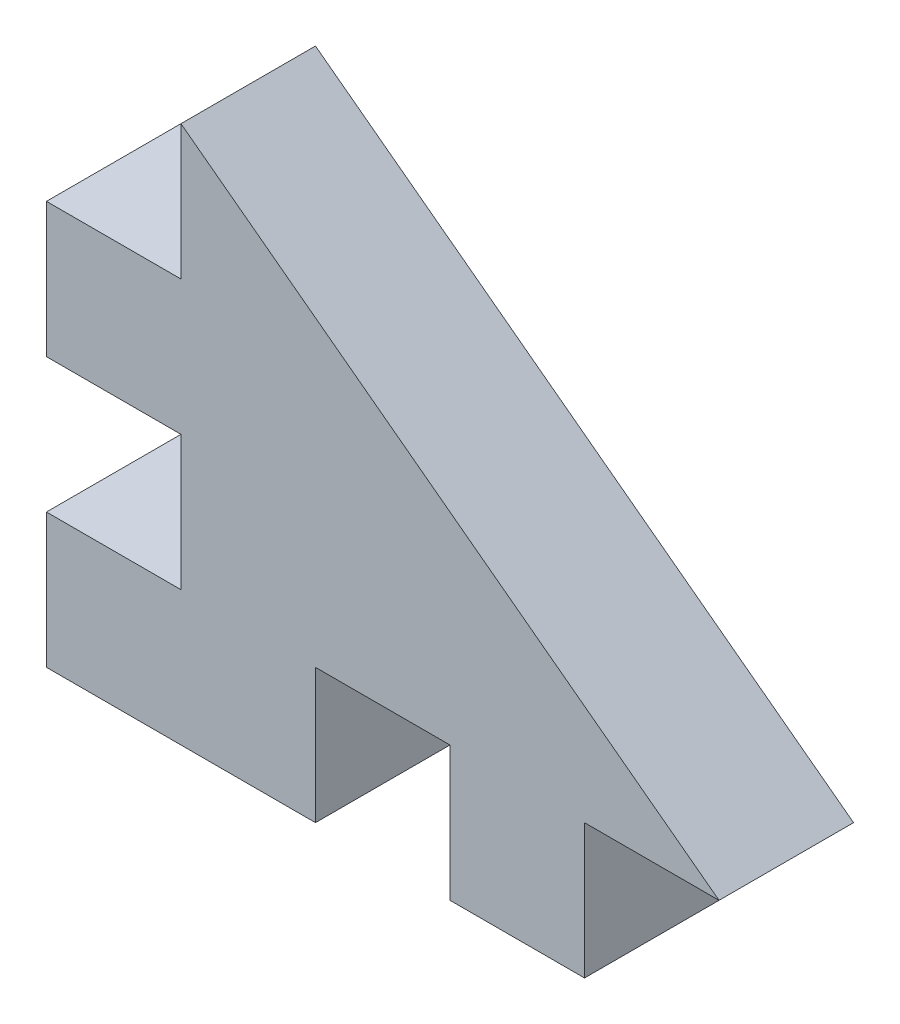
ISO-10303-21;
HEADER;
FILE_DESCRIPTION(('STEP AP214'),'2;1');
FILE_NAME('part.step','',(''),(''),'','','');
FILE_SCHEMA(('AUTOMOTIVE_DESIGN { 1 0 10303 214 1 1 1 1 }'));
ENDSEC;
DATA;
#1=APPLICATION_CONTEXT('core data for automotive mechanical design processes');
#2=APPLICATION_PROTOCOL_DEFINITION('international standard','automotive_design',2000,#1);
#3=PRODUCT_CONTEXT('',#1,'mechanical');
#4=PRODUCT('Part','Part','',(#3));
#5=PRODUCT_RELATED_PRODUCT_CATEGORY('part','',(#4));
#6=PRODUCT_DEFINITION_FORMATION('','',#4);
#7=PRODUCT_DEFINITION_CONTEXT('part definition',#1,'design');
#8=PRODUCT_DEFINITION('design','',#6,#7);
#9=PRODUCT_DEFINITION_SHAPE('','',#8);
#10=(LENGTH_UNIT() NAMED_UNIT(*) SI_UNIT(.MILLI.,.METRE.));
#11=(NAMED_UNIT(*) PLANE_ANGLE_UNIT() SI_UNIT($,.RADIAN.));
#12=(NAMED_UNIT(*) SI_UNIT($,.STERADIAN.) SOLID_ANGLE_UNIT());
#13=UNCERTAINTY_MEASURE_WITH_UNIT(LENGTH_MEASURE(1.E-05),#10,'distance_accuracy_value','');
#14=(GEOMETRIC_REPRESENTATION_CONTEXT(3) GLOBAL_UNCERTAINTY_ASSIGNED_CONTEXT((#13)) GLOBAL_UNIT_ASSIGNED_CONTEXT((#10,
#11,#12)) REPRESENTATION_CONTEXT('',''));
#15=CARTESIAN_POINT('',(0.,0.,0.));
#16=DIRECTION('',(0.,0.,1.));
#17=DIRECTION('',(1.,0.,0.));
#18=AXIS2_PLACEMENT_3D('',#15,#16,#17);
#19=CARTESIAN_POINT('',(0.,0.,5.));
#20=DIRECTION('',(0.,0.,1.));
#21=DIRECTION('',(1.,0.,0.));
#22=AXIS2_PLACEMENT_3D('',#19,#20,#21);
#23=PLANE('',#22);
#24=DIRECTION('',(0.,1.,0.));
#25=VECTOR('',#24,1.);
#26=CARTESIAN_POINT('',(-23.2430417966123,0.,5.));
#27=LINE('',#26,#25);
#28=CARTESIAN_POINT('',(-23.2430417966123,-5.73647342995169,5.));
#29=VERTEX_POINT('',#28);
#30=CARTESIAN_POINT('',(-23.2430417966123,-0.736473429951691,5.));
#31=VERTEX_POINT('',#30);
#32=EDGE_CURVE('E223',#29,#31,#27,.T.);
#33=ORIENTED_EDGE('',*,*,#32,.T.);
#34=DIRECTION('',(1.,0.,0.));
#35=VECTOR('',#34,1.);
#36=CARTESIAN_POINT('',(0.,-0.736473429951691,5.));
#37=LINE('',#36,#35);
#38=CARTESIAN_POINT('',(-18.2430417966123,-0.736473429951584,5.));
#39=VERTEX_POINT('',#38);
#40=EDGE_CURVE('E207',#31,#39,#37,.T.);
#41=ORIENTED_EDGE('',*,*,#40,.T.);
#42=DIRECTION('',(0.800000000000003,-0.599999999999996,0.));
#43=VECTOR('',#42,1.);
#44=CARTESIAN_POINT('',(-6.92100229315709,-9.22800305754288,5.));
#45=LINE('',#44,#43);
#46=CARTESIAN_POINT('',(-38.2430417966123,14.2635265700483,5.));
#47=VERTEX_POINT('',#46);
#48=EDGE_CURVE('E221',#47,#39,#45,.T.);
#49=ORIENTED_EDGE('',*,*,#48,.F.);
#50=DIRECTION('',(0.,1.,0.));
#51=VECTOR('',#50,1.);
#52=CARTESIAN_POINT('',(-38.2430417966123,0.,5.));
#53=LINE('',#52,#51);
#54=CARTESIAN_POINT('',(-38.2430417966123,9.26352657004831,5.));
#55=VERTEX_POINT('',#54);
#56=EDGE_CURVE('E229',#55,#47,#53,.T.);
#57=ORIENTED_EDGE('',*,*,#56,.F.);
#58=DIRECTION('',(1.,0.,0.));
#59=VECTOR('',#58,1.);
#60=CARTESIAN_POINT('',(0.,9.26352657004831,5.));
#61=LINE('',#60,#59);
#62=CARTESIAN_POINT('',(-43.2430417966123,9.26352657004831,5.));
#63=VERTEX_POINT('',#62);
#64=EDGE_CURVE('E232',#63,#55,#61,.T.);
#65=ORIENTED_EDGE('',*,*,#64,.F.);
#66=DIRECTION('',(0.,-1.,0.));
#67=VECTOR('',#66,1.);
#68=CARTESIAN_POINT('',(-43.2430417966123,14.2635265700483,5.));
#69=LINE('',#68,#67);
#70=CARTESIAN_POINT('',(-43.2430417966123,4.26352657004831,5.));
#71=VERTEX_POINT('',#70);
#72=EDGE_CURVE('E237',#63,#71,#69,.T.);
#73=ORIENTED_EDGE('',*,*,#72,.T.);
#74=DIRECTION('',(1.,0.,0.));
#75=VECTOR('',#74,1.);
#76=CARTESIAN_POINT('',(0.,4.26352657004831,5.));
#77=LINE('',#76,#75);
#78=CARTESIAN_POINT('',(-38.2430417966123,4.26352657004831,5.));
#79=VERTEX_POINT('',#78);
#80=EDGE_CURVE('E297',#71,#79,#77,.T.);
#81=ORIENTED_EDGE('',*,*,#80,.T.);
#82=DIRECTION('',(0.,1.,0.));
#83=VECTOR('',#82,1.);
#84=CARTESIAN_POINT('',(-38.2430417966123,0.,5.));
#85=LINE('',#84,#83);
#86=CARTESIAN_POINT('',(-38.2430417966123,-0.736473429951691,5.));
#87=VERTEX_POINT('',#86);
#88=EDGE_CURVE('E305',#87,#79,#85,.T.);
#89=ORIENTED_EDGE('',*,*,#88,.F.);
#90=DIRECTION('',(1.,0.,0.));
#91=VECTOR('',#90,1.);
#92=CARTESIAN_POINT('',(0.,-0.736473429951691,5.));
#93=LINE('',#92,#91);
#94=CARTESIAN_POINT('',(-43.2430417966123,-0.736473429951691,5.));
#95=VERTEX_POINT('',#94);
#96=EDGE_CURVE('E288',#95,#87,#93,.T.);
#97=ORIENTED_EDGE('',*,*,#96,.F.);
#98=CARTESIAN_POINT('',(-43.2430417966123,-5.73647342995169,5.));
#99=VERTEX_POINT('',#98);
#100=EDGE_CURVE('E241',#95,#99,#69,.T.);
#101=ORIENTED_EDGE('',*,*,#100,.T.);
#102=DIRECTION('',(1.,0.,0.));
#103=VECTOR('',#102,1.);
#104=CARTESIAN_POINT('',(-43.2430417966123,-5.73647342995169,5.));
#105=LINE('',#104,#103);
#106=CARTESIAN_POINT('',(-33.2430417966123,-5.73647342995169,5.));
#107=VERTEX_POINT('',#106);
#108=EDGE_CURVE('E103',#99,#107,#105,.T.);
#109=ORIENTED_EDGE('',*,*,#108,.T.);
#110=DIRECTION('',(0.,1.,0.));
#111=VECTOR('',#110,1.);
#112=CARTESIAN_POINT('',(-33.2430417966123,0.,5.));
#113=LINE('',#112,#111);
#114=CARTESIAN_POINT('',(-33.2430417966123,-0.736473429951691,5.));
#115=VERTEX_POINT('',#114);
#116=EDGE_CURVE('E278',#107,#115,#113,.T.);
#117=ORIENTED_EDGE('',*,*,#116,.T.);
#118=DIRECTION('',(1.,0.,0.));
#119=VECTOR('',#118,1.);
#120=CARTESIAN_POINT('',(0.,-0.736473429951691,5.));
#121=LINE('',#120,#119);
#122=CARTESIAN_POINT('',(-28.2430417966123,-0.736473429951691,5.));
#123=VERTEX_POINT('',#122);
#124=EDGE_CURVE('E271',#115,#123,#121,.T.);
#125=ORIENTED_EDGE('',*,*,#124,.T.);
#126=DIRECTION('',(0.,1.,0.));
#127=VECTOR('',#126,1.);
#128=CARTESIAN_POINT('',(-28.2430417966123,0.,5.));
#129=LINE('',#128,#127);
#130=CARTESIAN_POINT('',(-28.2430417966123,-5.73647342995169,5.));
#131=VERTEX_POINT('',#130);
#132=EDGE_CURVE('E269',#131,#123,#129,.T.);
#133=ORIENTED_EDGE('',*,*,#132,.F.);
#134=EDGE_CURVE('E240',#131,#29,#105,.T.);
#135=ORIENTED_EDGE('',*,*,#134,.T.);
#136=EDGE_LOOP('',(#33,#41,#49,#57,#65,#73,#81,#89,#97,#101,#109,#117,#125,#133,#135));
#137=FACE_BOUND('',#136,.T.);
#138=ADVANCED_FACE('F95',(#137),#23,.T.);
#139=CARTESIAN_POINT('',(0.,0.,0.));
#140=DIRECTION('',(0.,0.,1.));
#141=DIRECTION('',(1.,0.,0.));
#142=AXIS2_PLACEMENT_3D('',#139,#140,#141);
#143=PLANE('',#142);
#144=DIRECTION('',(1.,0.,0.));
#145=VECTOR('',#144,1.);
#146=CARTESIAN_POINT('',(0.,-0.736473429951691,0.));
#147=LINE('',#146,#145);
#148=CARTESIAN_POINT('',(-23.2430417966123,-0.736473429951691,0.));
#149=VERTEX_POINT('',#148);
#150=CARTESIAN_POINT('',(-18.2430417966123,-0.736473429951579,0.));
#151=VERTEX_POINT('',#150);
#152=EDGE_CURVE('E210',#149,#151,#147,.T.);
#153=ORIENTED_EDGE('',*,*,#152,.F.);
#154=DIRECTION('',(0.,1.,0.));
#155=VECTOR('',#154,1.);
#156=CARTESIAN_POINT('',(-23.2430417966123,0.,0.));
#157=LINE('',#156,#155);
#158=CARTESIAN_POINT('',(-23.2430417966123,-5.73647342995169,0.));
#159=VERTEX_POINT('',#158);
#160=EDGE_CURVE('E267',#159,#149,#157,.T.);
#161=ORIENTED_EDGE('',*,*,#160,.F.);
#162=DIRECTION('',(1.,0.,0.));
#163=VECTOR('',#162,1.);
#164=CARTESIAN_POINT('',(-43.2430417966123,-5.73647342995169,0.));
#165=LINE('',#164,#163);
#166=CARTESIAN_POINT('',(-28.2430417966123,-5.73647342995169,0.));
#167=VERTEX_POINT('',#166);
#168=EDGE_CURVE('E246',#167,#159,#165,.T.);
#169=ORIENTED_EDGE('',*,*,#168,.F.);
#170=DIRECTION('',(0.,1.,0.));
#171=VECTOR('',#170,1.);
#172=CARTESIAN_POINT('',(-28.2430417966123,0.,0.));
#173=LINE('',#172,#171);
#174=CARTESIAN_POINT('',(-28.2430417966123,-0.736473429951691,0.));
#175=VERTEX_POINT('',#174);
#176=EDGE_CURVE('E266',#167,#175,#173,.T.);
#177=ORIENTED_EDGE('',*,*,#176,.T.);
#178=DIRECTION('',(1.,0.,0.));
#179=VECTOR('',#178,1.);
#180=CARTESIAN_POINT('',(0.,-0.736473429951691,0.));
#181=LINE('',#180,#179);
#182=CARTESIAN_POINT('',(-33.2430417966123,-0.736473429951691,0.));
#183=VERTEX_POINT('',#182);
#184=EDGE_CURVE('E277',#183,#175,#181,.T.);
#185=ORIENTED_EDGE('',*,*,#184,.F.);
#186=DIRECTION('',(0.,1.,0.));
#187=VECTOR('',#186,1.);
#188=CARTESIAN_POINT('',(-33.2430417966123,0.,0.));
#189=LINE('',#188,#187);
#190=CARTESIAN_POINT('',(-33.2430417966123,-5.73647342995169,0.));
#191=VERTEX_POINT('',#190);
#192=EDGE_CURVE('E280',#191,#183,#189,.T.);
#193=ORIENTED_EDGE('',*,*,#192,.F.);
#194=CARTESIAN_POINT('',(-43.2430417966123,-5.73647342995169,0.));
#195=VERTEX_POINT('',#194);
#196=EDGE_CURVE('E247',#195,#191,#165,.T.);
#197=ORIENTED_EDGE('',*,*,#196,.F.);
#198=DIRECTION('',(0.,-1.,0.));
#199=VECTOR('',#198,1.);
#200=CARTESIAN_POINT('',(-43.2430417966123,14.2635265700483,0.));
#201=LINE('',#200,#199);
#202=CARTESIAN_POINT('',(-43.2430417966123,-0.736473429951691,0.));
#203=VERTEX_POINT('',#202);
#204=EDGE_CURVE('E215',#203,#195,#201,.T.);
#205=ORIENTED_EDGE('',*,*,#204,.F.);
#206=DIRECTION('',(1.,0.,0.));
#207=VECTOR('',#206,1.);
#208=CARTESIAN_POINT('',(0.,-0.736473429951691,0.));
#209=LINE('',#208,#207);
#210=CARTESIAN_POINT('',(-38.2430417966123,-0.736473429951691,0.));
#211=VERTEX_POINT('',#210);
#212=EDGE_CURVE('E293',#203,#211,#209,.T.);
#213=ORIENTED_EDGE('',*,*,#212,.T.);
#214=DIRECTION('',(0.,1.,0.));
#215=VECTOR('',#214,1.);
#216=CARTESIAN_POINT('',(-38.2430417966123,0.,0.));
#217=LINE('',#216,#215);
#218=CARTESIAN_POINT('',(-38.2430417966123,4.26352657004831,0.));
#219=VERTEX_POINT('',#218);
#220=EDGE_CURVE('E296',#211,#219,#217,.T.);
#221=ORIENTED_EDGE('',*,*,#220,.T.);
#222=DIRECTION('',(1.,0.,0.));
#223=VECTOR('',#222,1.);
#224=CARTESIAN_POINT('',(0.,4.26352657004831,0.));
#225=LINE('',#224,#223);
#226=CARTESIAN_POINT('',(-43.2430417966123,4.26352657004831,0.));
#227=VERTEX_POINT('',#226);
#228=EDGE_CURVE('E300',#227,#219,#225,.T.);
#229=ORIENTED_EDGE('',*,*,#228,.F.);
#230=CARTESIAN_POINT('',(-43.2430417966123,9.26352657004831,0.));
#231=VERTEX_POINT('',#230);
#232=EDGE_CURVE('E244',#231,#227,#201,.T.);
#233=ORIENTED_EDGE('',*,*,#232,.F.);
#234=DIRECTION('',(1.,0.,0.));
#235=VECTOR('',#234,1.);
#236=CARTESIAN_POINT('',(0.,9.26352657004831,0.));
#237=LINE('',#236,#235);
#238=CARTESIAN_POINT('',(-38.2430417966123,9.26352657004831,0.));
#239=VERTEX_POINT('',#238);
#240=EDGE_CURVE('E311',#231,#239,#237,.T.);
#241=ORIENTED_EDGE('',*,*,#240,.T.);
#242=DIRECTION('',(0.,1.,0.));
#243=VECTOR('',#242,1.);
#244=CARTESIAN_POINT('',(-38.2430417966123,0.,0.));
#245=LINE('',#244,#243);
#246=CARTESIAN_POINT('',(-38.2430417966123,14.2635265700483,0.));
#247=VERTEX_POINT('',#246);
#248=EDGE_CURVE('E320',#239,#247,#245,.T.);
#249=ORIENTED_EDGE('',*,*,#248,.T.);
#250=DIRECTION('',(0.800000000000003,-0.599999999999996,0.));
#251=VECTOR('',#250,1.);
#252=CARTESIAN_POINT('',(-6.92100229315709,-9.22800305754288,0.));
#253=LINE('',#252,#251);
#254=EDGE_CURVE('E228',#247,#151,#253,.T.);
#255=ORIENTED_EDGE('',*,*,#254,.T.);
#256=EDGE_LOOP('',(#153,#161,#169,#177,#185,#193,#197,#205,#213,#221,#229,#233,#241,#249,#255));
#257=FACE_BOUND('',#256,.T.);
#258=ADVANCED_FACE('F264',(#257),#143,.F.);
#259=CARTESIAN_POINT('',(-43.2430417966123,-5.73647342995169,5.));
#260=DIRECTION('',(0.,1.,0.));
#261=DIRECTION('',(0.,0.,1.));
#262=AXIS2_PLACEMENT_3D('',#259,#260,#261);
#263=PLANE('',#262);
#264=DIRECTION('',(0.,0.,1.));
#265=VECTOR('',#264,1.);
#266=CARTESIAN_POINT('',(-23.2430417966123,-5.73647342995169,0.));
#267=LINE('',#266,#265);
#268=EDGE_CURVE('E259',#159,#29,#267,.T.);
#269=ORIENTED_EDGE('',*,*,#268,.T.);
#270=ORIENTED_EDGE('',*,*,#134,.F.);
#271=DIRECTION('',(0.,0.,1.));
#272=VECTOR('',#271,1.);
#273=CARTESIAN_POINT('',(-28.2430417966123,-5.73647342995169,0.));
#274=LINE('',#273,#272);
#275=EDGE_CURVE('E260',#167,#131,#274,.T.);
#276=ORIENTED_EDGE('',*,*,#275,.F.);
#277=ORIENTED_EDGE('',*,*,#168,.T.);
#278=EDGE_LOOP('',(#269,#270,#276,#277));
#279=FACE_BOUND('',#278,.T.);
#280=ADVANCED_FACE('F257',(#279),#263,.F.);
#281=DIRECTION('',(0.,0.,1.));
#282=VECTOR('',#281,1.);
#283=CARTESIAN_POINT('',(-33.2430417966123,-5.73647342995169,0.));
#284=LINE('',#283,#282);
#285=EDGE_CURVE('E286',#191,#107,#284,.T.);
#286=ORIENTED_EDGE('',*,*,#285,.T.);
#287=ORIENTED_EDGE('',*,*,#108,.F.);
#288=DIRECTION('',(0.,0.,-1.));
#289=VECTOR('',#288,1.);
#290=CARTESIAN_POINT('',(-43.2430417966123,-5.73647342995169,5.));
#291=LINE('',#290,#289);
#292=EDGE_CURVE('E12',#99,#195,#291,.T.);
#293=ORIENTED_EDGE('',*,*,#292,.T.);
#294=ORIENTED_EDGE('',*,*,#196,.T.);
#295=EDGE_LOOP('',(#286,#287,#293,#294));
#296=FACE_BOUND('',#295,.T.);
#297=ADVANCED_FACE('F358',(#296),#263,.F.);
#298=CARTESIAN_POINT('',(-43.2430417966123,14.2635265700483,5.));
#299=DIRECTION('',(1.,0.,0.));
#300=DIRECTION('',(0.,1.,0.));
#301=AXIS2_PLACEMENT_3D('',#298,#299,#300);
#302=PLANE('',#301);
#303=DIRECTION('',(0.,0.,1.));
#304=VECTOR('',#303,1.);
#305=CARTESIAN_POINT('',(-43.2430417966123,4.26352657004831,0.));
#306=LINE('',#305,#304);
#307=EDGE_CURVE('E312',#227,#71,#306,.T.);
#308=ORIENTED_EDGE('',*,*,#307,.T.);
#309=ORIENTED_EDGE('',*,*,#72,.F.);
#310=DIRECTION('',(0.,0.,1.));
#311=VECTOR('',#310,1.);
#312=CARTESIAN_POINT('',(-43.2430417966123,9.26352657004831,0.));
#313=LINE('',#312,#311);
#314=EDGE_CURVE('E319',#231,#63,#313,.T.);
#315=ORIENTED_EDGE('',*,*,#314,.F.);
#316=ORIENTED_EDGE('',*,*,#232,.T.);
#317=EDGE_LOOP('',(#308,#309,#315,#316));
#318=FACE_BOUND('',#317,.T.);
#319=ADVANCED_FACE('F335',(#318),#302,.F.);
#320=ORIENTED_EDGE('',*,*,#100,.F.);
#321=DIRECTION('',(0.,0.,1.));
#322=VECTOR('',#321,1.);
#323=CARTESIAN_POINT('',(-43.2430417966123,-0.736473429951691,0.));
#324=LINE('',#323,#322);
#325=EDGE_CURVE('E309',#203,#95,#324,.T.);
#326=ORIENTED_EDGE('',*,*,#325,.F.);
#327=ORIENTED_EDGE('',*,*,#204,.T.);
#328=ORIENTED_EDGE('',*,*,#292,.F.);
#329=EDGE_LOOP('',(#320,#326,#327,#328));
#330=FACE_BOUND('',#329,.T.);
#331=ADVANCED_FACE('F97',(#330),#302,.F.);
#332=CARTESIAN_POINT('',(-6.92100229315709,-9.22800305754288,0.));
#333=DIRECTION('',(-0.599999999999996,-0.800000000000003,0.));
#334=DIRECTION('',(0.800000000000003,-0.599999999999996,0.));
#335=AXIS2_PLACEMENT_3D('',#332,#333,#334);
#336=PLANE('',#335);
#337=ORIENTED_EDGE('',*,*,#48,.T.);
#338=DIRECTION('',(0.,0.,1.));
#339=VECTOR('',#338,1.);
#340=CARTESIAN_POINT('',(-18.2430417966123,-0.736473429951584,0.));
#341=LINE('',#340,#339);
#342=EDGE_CURVE('E203',#151,#39,#341,.T.);
#343=ORIENTED_EDGE('',*,*,#342,.F.);
#344=ORIENTED_EDGE('',*,*,#254,.F.);
#345=DIRECTION('',(0.,0.,1.));
#346=VECTOR('',#345,1.);
#347=CARTESIAN_POINT('',(-38.2430417966123,14.2635265700483,0.));
#348=LINE('',#347,#346);
#349=EDGE_CURVE('E216',#247,#47,#348,.T.);
#350=ORIENTED_EDGE('',*,*,#349,.T.);
#351=EDGE_LOOP('',(#337,#343,#344,#350));
#352=FACE_BOUND('',#351,.T.);
#353=ADVANCED_FACE('F227',(#352),#336,.F.);
#354=CARTESIAN_POINT('',(0.,9.26352657004831,0.));
#355=DIRECTION('',(0.,-1.,0.));
#356=DIRECTION('',(0.,0.,-1.));
#357=AXIS2_PLACEMENT_3D('',#354,#355,#356);
#358=PLANE('',#357);
#359=ORIENTED_EDGE('',*,*,#64,.T.);
#360=DIRECTION('',(0.,0.,1.));
#361=VECTOR('',#360,1.);
#362=CARTESIAN_POINT('',(-38.2430417966123,9.26352657004831,0.));
#363=LINE('',#362,#361);
#364=EDGE_CURVE('E317',#239,#55,#363,.T.);
#365=ORIENTED_EDGE('',*,*,#364,.F.);
#366=ORIENTED_EDGE('',*,*,#240,.F.);
#367=ORIENTED_EDGE('',*,*,#314,.T.);
#368=EDGE_LOOP('',(#359,#365,#366,#367));
#369=FACE_BOUND('',#368,.T.);
#370=ADVANCED_FACE('F331',(#369),#358,.F.);
#371=CARTESIAN_POINT('',(-38.2430417966123,0.,0.));
#372=DIRECTION('',(1.,0.,0.));
#373=DIRECTION('',(0.,0.,-1.));
#374=AXIS2_PLACEMENT_3D('',#371,#372,#373);
#375=PLANE('',#374);
#376=ORIENTED_EDGE('',*,*,#56,.T.);
#377=ORIENTED_EDGE('',*,*,#349,.F.);
#378=ORIENTED_EDGE('',*,*,#248,.F.);
#379=ORIENTED_EDGE('',*,*,#364,.T.);
#380=EDGE_LOOP('',(#376,#377,#378,#379));
#381=FACE_BOUND('',#380,.T.);
#382=ADVANCED_FACE('F338',(#381),#375,.F.);
#383=CARTESIAN_POINT('',(0.,-0.736473429951691,0.));
#384=DIRECTION('',(0.,-1.,0.));
#385=DIRECTION('',(0.,0.,-1.));
#386=AXIS2_PLACEMENT_3D('',#383,#384,#385);
#387=PLANE('',#386);
#388=ORIENTED_EDGE('',*,*,#96,.T.);
#389=DIRECTION('',(0.,0.,1.));
#390=VECTOR('',#389,1.);
#391=CARTESIAN_POINT('',(-38.2430417966123,-0.736473429951691,0.));
#392=LINE('',#391,#390);
#393=EDGE_CURVE('E302',#211,#87,#392,.T.);
#394=ORIENTED_EDGE('',*,*,#393,.F.);
#395=ORIENTED_EDGE('',*,*,#212,.F.);
#396=ORIENTED_EDGE('',*,*,#325,.T.);
#397=EDGE_LOOP('',(#388,#394,#395,#396));
#398=FACE_BOUND('',#397,.T.);
#399=ADVANCED_FACE('F340',(#398),#387,.F.);
#400=CARTESIAN_POINT('',(0.,4.26352657004831,0.));
#401=DIRECTION('',(0.,-1.,0.));
#402=DIRECTION('',(0.,0.,-1.));
#403=AXIS2_PLACEMENT_3D('',#400,#401,#402);
#404=PLANE('',#403);
#405=ORIENTED_EDGE('',*,*,#80,.F.);
#406=ORIENTED_EDGE('',*,*,#307,.F.);
#407=ORIENTED_EDGE('',*,*,#228,.T.);
#408=DIRECTION('',(0.,0.,1.));
#409=VECTOR('',#408,1.);
#410=CARTESIAN_POINT('',(-38.2430417966123,4.26352657004831,0.));
#411=LINE('',#410,#409);
#412=EDGE_CURVE('E118',#219,#79,#411,.T.);
#413=ORIENTED_EDGE('',*,*,#412,.T.);
#414=EDGE_LOOP('',(#405,#406,#407,#413));
#415=FACE_BOUND('',#414,.T.);
#416=ADVANCED_FACE('F346',(#415),#404,.T.);
#417=CARTESIAN_POINT('',(-38.2430417966123,0.,0.));
#418=DIRECTION('',(1.,0.,0.));
#419=DIRECTION('',(0.,0.,-1.));
#420=AXIS2_PLACEMENT_3D('',#417,#418,#419);
#421=PLANE('',#420);
#422=ORIENTED_EDGE('',*,*,#88,.T.);
#423=ORIENTED_EDGE('',*,*,#412,.F.);
#424=ORIENTED_EDGE('',*,*,#220,.F.);
#425=ORIENTED_EDGE('',*,*,#393,.T.);
#426=EDGE_LOOP('',(#422,#423,#424,#425));
#427=FACE_BOUND('',#426,.T.);
#428=ADVANCED_FACE('F394',(#427),#421,.F.);
#429=CARTESIAN_POINT('',(-33.2430417966123,0.,0.));
#430=DIRECTION('',(1.,0.,0.));
#431=DIRECTION('',(0.,0.,-1.));
#432=AXIS2_PLACEMENT_3D('',#429,#430,#431);
#433=PLANE('',#432);
#434=ORIENTED_EDGE('',*,*,#116,.F.);
#435=ORIENTED_EDGE('',*,*,#285,.F.);
#436=ORIENTED_EDGE('',*,*,#192,.T.);
#437=DIRECTION('',(0.,0.,1.));
#438=VECTOR('',#437,1.);
#439=CARTESIAN_POINT('',(-33.2430417966123,-0.736473429951691,0.));
#440=LINE('',#439,#438);
#441=EDGE_CURVE('E289',#183,#115,#440,.T.);
#442=ORIENTED_EDGE('',*,*,#441,.T.);
#443=EDGE_LOOP('',(#434,#435,#436,#442));
#444=FACE_BOUND('',#443,.T.);
#445=ADVANCED_FACE('F375',(#444),#433,.T.);
#446=CARTESIAN_POINT('',(0.,-0.736473429951691,0.));
#447=DIRECTION('',(0.,-1.,0.));
#448=DIRECTION('',(0.,0.,-1.));
#449=AXIS2_PLACEMENT_3D('',#446,#447,#448);
#450=PLANE('',#449);
#451=ORIENTED_EDGE('',*,*,#124,.F.);
#452=ORIENTED_EDGE('',*,*,#441,.F.);
#453=ORIENTED_EDGE('',*,*,#184,.T.);
#454=DIRECTION('',(0.,0.,1.));
#455=VECTOR('',#454,1.);
#456=CARTESIAN_POINT('',(-28.2430417966123,-0.736473429951691,0.));
#457=LINE('',#456,#455);
#458=EDGE_CURVE('E110',#175,#123,#457,.T.);
#459=ORIENTED_EDGE('',*,*,#458,.T.);
#460=EDGE_LOOP('',(#451,#452,#453,#459));
#461=FACE_BOUND('',#460,.T.);
#462=ADVANCED_FACE('F378',(#461),#450,.T.);
#463=CARTESIAN_POINT('',(-28.2430417966123,0.,0.));
#464=DIRECTION('',(1.,0.,0.));
#465=DIRECTION('',(0.,0.,-1.));
#466=AXIS2_PLACEMENT_3D('',#463,#464,#465);
#467=PLANE('',#466);
#468=ORIENTED_EDGE('',*,*,#132,.T.);
#469=ORIENTED_EDGE('',*,*,#458,.F.);
#470=ORIENTED_EDGE('',*,*,#176,.F.);
#471=ORIENTED_EDGE('',*,*,#275,.T.);
#472=EDGE_LOOP('',(#468,#469,#470,#471));
#473=FACE_BOUND('',#472,.T.);
#474=ADVANCED_FACE('F380',(#473),#467,.F.);
#475=CARTESIAN_POINT('',(0.,-0.736473429951691,0.));
#476=DIRECTION('',(0.,-1.,0.));
#477=DIRECTION('',(0.,0.,-1.));
#478=AXIS2_PLACEMENT_3D('',#475,#476,#477);
#479=PLANE('',#478);
#480=ORIENTED_EDGE('',*,*,#40,.F.);
#481=DIRECTION('',(0.,0.,1.));
#482=VECTOR('',#481,1.);
#483=CARTESIAN_POINT('',(-23.2430417966123,-0.736473429951691,0.));
#484=LINE('',#483,#482);
#485=EDGE_CURVE('E224',#149,#31,#484,.T.);
#486=ORIENTED_EDGE('',*,*,#485,.F.);
#487=ORIENTED_EDGE('',*,*,#152,.T.);
#488=ORIENTED_EDGE('',*,*,#342,.T.);
#489=EDGE_LOOP('',(#480,#486,#487,#488));
#490=FACE_BOUND('',#489,.T.);
#491=ADVANCED_FACE('F205',(#490),#479,.T.);
#492=CARTESIAN_POINT('',(-23.2430417966123,0.,0.));
#493=DIRECTION('',(1.,0.,0.));
#494=DIRECTION('',(0.,0.,-1.));
#495=AXIS2_PLACEMENT_3D('',#492,#493,#494);
#496=PLANE('',#495);
#497=ORIENTED_EDGE('',*,*,#32,.F.);
#498=ORIENTED_EDGE('',*,*,#268,.F.);
#499=ORIENTED_EDGE('',*,*,#160,.T.);
#500=ORIENTED_EDGE('',*,*,#485,.T.);
#501=EDGE_LOOP('',(#497,#498,#499,#500));
#502=FACE_BOUND('',#501,.T.);
#503=ADVANCED_FACE('F387',(#502),#496,.T.);
#504=CLOSED_SHELL('',(#138,#258,#280,#297,#319,#331,#353,#370,#382,#399,#416,#428,#445,#462,
#474,#491,#503));
#505=MANIFOLD_SOLID_BREP('B2',#504);
#506=ADVANCED_BREP_SHAPE_REPRESENTATION('',(#18,#505),#14);
#507=SHAPE_DEFINITION_REPRESENTATION(#9,#506);
ENDSEC;
END-ISO-10303-21;
